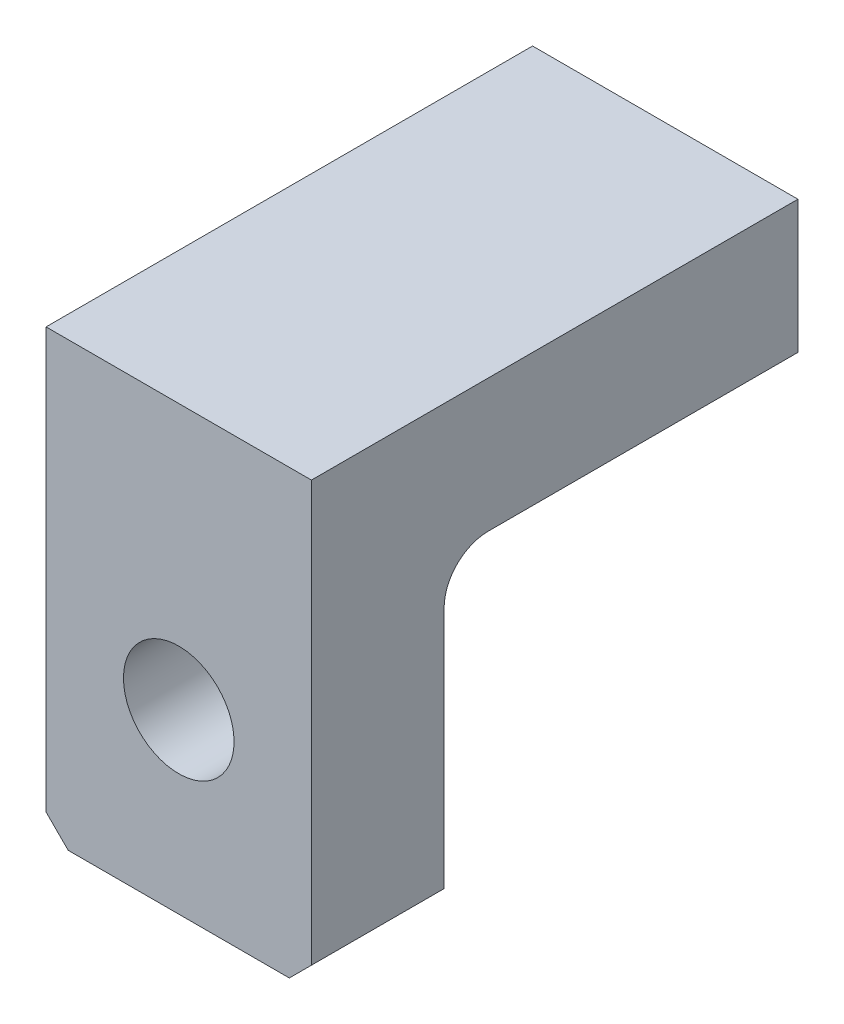
ISO-10303-21;
HEADER;
FILE_DESCRIPTION(('STEP AP214'),'2;1');
FILE_NAME('part.step','',(''),(''),'','','');
FILE_SCHEMA(('AUTOMOTIVE_DESIGN { 1 0 10303 214 1 1 1 1 }'));
ENDSEC;
DATA;
#1=APPLICATION_CONTEXT('core data for automotive mechanical design processes');
#2=APPLICATION_PROTOCOL_DEFINITION('international standard','automotive_design',2000,#1);
#3=PRODUCT_CONTEXT('',#1,'mechanical');
#4=PRODUCT('Part','Part','',(#3));
#5=PRODUCT_RELATED_PRODUCT_CATEGORY('part','',(#4));
#6=PRODUCT_DEFINITION_FORMATION('','',#4);
#7=PRODUCT_DEFINITION_CONTEXT('part definition',#1,'design');
#8=PRODUCT_DEFINITION('design','',#6,#7);
#9=PRODUCT_DEFINITION_SHAPE('','',#8);
#10=(LENGTH_UNIT() NAMED_UNIT(*) SI_UNIT(.MILLI.,.METRE.));
#11=(NAMED_UNIT(*) PLANE_ANGLE_UNIT() SI_UNIT($,.RADIAN.));
#12=(NAMED_UNIT(*) SI_UNIT($,.STERADIAN.) SOLID_ANGLE_UNIT());
#13=UNCERTAINTY_MEASURE_WITH_UNIT(LENGTH_MEASURE(1.E-05),#10,'distance_accuracy_value','');
#14=(GEOMETRIC_REPRESENTATION_CONTEXT(3) GLOBAL_UNCERTAINTY_ASSIGNED_CONTEXT((#13)) GLOBAL_UNIT_ASSIGNED_CONTEXT((#10,
#11,#12)) REPRESENTATION_CONTEXT('',''));
#15=CARTESIAN_POINT('',(0.,0.,0.));
#16=DIRECTION('',(0.,0.,1.));
#17=DIRECTION('',(1.,0.,0.));
#18=AXIS2_PLACEMENT_3D('',#15,#16,#17);
#19=CARTESIAN_POINT('',(0.,0.,30.));
#20=DIRECTION('',(1.,0.,0.));
#21=DIRECTION('',(0.,0.,-1.));
#22=AXIS2_PLACEMENT_3D('',#19,#20,#21);
#23=PLANE('',#22);
#24=DIRECTION('',(0.,-1.,0.));
#25=VECTOR('',#24,1.);
#26=CARTESIAN_POINT('',(0.,0.,0.));
#27=LINE('',#26,#25);
#28=CARTESIAN_POINT('',(0.,60.,0.));
#29=VERTEX_POINT('',#28);
#30=CARTESIAN_POINT('',(0.,5.,0.));
#31=VERTEX_POINT('',#30);
#32=EDGE_CURVE('E136',#29,#31,#27,.T.);
#33=ORIENTED_EDGE('',*,*,#32,.T.);
#34=DIRECTION('',(0.,0.,1.));
#35=VECTOR('',#34,1.);
#36=CARTESIAN_POINT('',(0.,5.,30.));
#37=LINE('',#36,#35);
#38=CARTESIAN_POINT('',(0.,5.,30.));
#39=VERTEX_POINT('',#38);
#40=EDGE_CURVE('E58',#31,#39,#37,.T.);
#41=ORIENTED_EDGE('',*,*,#40,.T.);
#42=DIRECTION('',(0.,-1.,0.));
#43=VECTOR('',#42,1.);
#44=CARTESIAN_POINT('',(0.,0.,30.));
#45=LINE('',#44,#43);
#46=CARTESIAN_POINT('',(0.,100.,30.));
#47=VERTEX_POINT('',#46);
#48=EDGE_CURVE('E143',#47,#39,#45,.T.);
#49=ORIENTED_EDGE('',*,*,#48,.F.);
#50=DIRECTION('',(0.,0.,-1.));
#51=VECTOR('',#50,1.);
#52=CARTESIAN_POINT('',(0.,100.,30.));
#53=LINE('',#52,#51);
#54=CARTESIAN_POINT('',(0.,100.,-80.));
#55=VERTEX_POINT('',#54);
#56=EDGE_CURVE('E151',#47,#55,#53,.T.);
#57=ORIENTED_EDGE('',*,*,#56,.T.);
#58=DIRECTION('',(0.,1.,0.));
#59=VECTOR('',#58,1.);
#60=CARTESIAN_POINT('',(0.,100.,-80.));
#61=LINE('',#60,#59);
#62=CARTESIAN_POINT('',(0.,70.,-80.));
#63=VERTEX_POINT('',#62);
#64=EDGE_CURVE('E121',#63,#55,#61,.T.);
#65=ORIENTED_EDGE('',*,*,#64,.F.);
#66=DIRECTION('',(0.,0.,1.));
#67=VECTOR('',#66,1.);
#68=CARTESIAN_POINT('',(0.,70.,-80.));
#69=LINE('',#68,#67);
#70=CARTESIAN_POINT('',(0.,70.,-9.99999999999999));
#71=VERTEX_POINT('',#70);
#72=EDGE_CURVE('E117',#63,#71,#69,.T.);
#73=ORIENTED_EDGE('',*,*,#72,.T.);
#74=CARTESIAN_POINT('',(0.,60.,-9.99999999999999));
#75=DIRECTION('',(1.,0.,0.));
#76=DIRECTION('',(0.,0.,-1.));
#77=AXIS2_PLACEMENT_3D('',#74,#75,#76);
#78=CIRCLE('',#77,10.);
#79=EDGE_CURVE('E164',#71,#29,#78,.T.);
#80=ORIENTED_EDGE('',*,*,#79,.T.);
#81=EDGE_LOOP('',(#33,#41,#49,#57,#65,#73,#80));
#82=FACE_BOUND('',#81,.T.);
#83=ADVANCED_FACE('F35',(#82),#23,.F.);
#84=CARTESIAN_POINT('',(0.,0.,30.));
#85=DIRECTION('',(0.,1.,0.));
#86=DIRECTION('',(0.,0.,1.));
#87=AXIS2_PLACEMENT_3D('',#84,#85,#86);
#88=PLANE('',#87);
#89=DIRECTION('',(1.,0.,0.));
#90=VECTOR('',#89,1.);
#91=CARTESIAN_POINT('',(0.,0.,30.));
#92=LINE('',#91,#90);
#93=CARTESIAN_POINT('',(4.99999999999999,0.,30.));
#94=VERTEX_POINT('',#93);
#95=CARTESIAN_POINT('',(55.,0.,30.));
#96=VERTEX_POINT('',#95);
#97=EDGE_CURVE('E145',#94,#96,#92,.T.);
#98=ORIENTED_EDGE('',*,*,#97,.F.);
#99=DIRECTION('',(0.,0.,-1.));
#100=VECTOR('',#99,1.);
#101=CARTESIAN_POINT('',(4.99999999999999,0.,30.));
#102=LINE('',#101,#100);
#103=CARTESIAN_POINT('',(4.99999999999999,0.,0.));
#104=VERTEX_POINT('',#103);
#105=EDGE_CURVE('E169',#94,#104,#102,.T.);
#106=ORIENTED_EDGE('',*,*,#105,.T.);
#107=DIRECTION('',(1.,0.,0.));
#108=VECTOR('',#107,1.);
#109=CARTESIAN_POINT('',(0.,0.,0.));
#110=LINE('',#109,#108);
#111=CARTESIAN_POINT('',(55.,0.,0.));
#112=VERTEX_POINT('',#111);
#113=EDGE_CURVE('E138',#104,#112,#110,.T.);
#114=ORIENTED_EDGE('',*,*,#113,.T.);
#115=DIRECTION('',(0.,0.,1.));
#116=VECTOR('',#115,1.);
#117=CARTESIAN_POINT('',(55.,0.,30.));
#118=LINE('',#117,#116);
#119=EDGE_CURVE('E167',#112,#96,#118,.T.);
#120=ORIENTED_EDGE('',*,*,#119,.T.);
#121=EDGE_LOOP('',(#98,#106,#114,#120));
#122=FACE_BOUND('',#121,.T.);
#123=ADVANCED_FACE('F183',(#122),#88,.F.);
#124=CARTESIAN_POINT('',(60.,0.,30.));
#125=DIRECTION('',(-1.,0.,0.));
#126=DIRECTION('',(0.,0.,1.));
#127=AXIS2_PLACEMENT_3D('',#124,#125,#126);
#128=PLANE('',#127);
#129=DIRECTION('',(0.,1.,0.));
#130=VECTOR('',#129,1.);
#131=CARTESIAN_POINT('',(60.,0.,30.));
#132=LINE('',#131,#130);
#133=CARTESIAN_POINT('',(60.,4.99999999999999,30.));
#134=VERTEX_POINT('',#133);
#135=CARTESIAN_POINT('',(60.,100.,30.));
#136=VERTEX_POINT('',#135);
#137=EDGE_CURVE('E148',#134,#136,#132,.T.);
#138=ORIENTED_EDGE('',*,*,#137,.F.);
#139=DIRECTION('',(0.,0.,-1.));
#140=VECTOR('',#139,1.);
#141=CARTESIAN_POINT('',(60.,4.99999999999999,30.));
#142=LINE('',#141,#140);
#143=CARTESIAN_POINT('',(60.,4.99999999999999,0.));
#144=VERTEX_POINT('',#143);
#145=EDGE_CURVE('E11',#134,#144,#142,.T.);
#146=ORIENTED_EDGE('',*,*,#145,.T.);
#147=DIRECTION('',(0.,1.,0.));
#148=VECTOR('',#147,1.);
#149=CARTESIAN_POINT('',(60.,0.,0.));
#150=LINE('',#149,#148);
#151=CARTESIAN_POINT('',(60.,60.,0.));
#152=VERTEX_POINT('',#151);
#153=EDGE_CURVE('E146',#144,#152,#150,.T.);
#154=ORIENTED_EDGE('',*,*,#153,.T.);
#155=CARTESIAN_POINT('',(60.,60.,-9.99999999999999));
#156=DIRECTION('',(-1.,0.,0.));
#157=DIRECTION('',(0.,0.,1.));
#158=AXIS2_PLACEMENT_3D('',#155,#156,#157);
#159=CIRCLE('',#158,10.);
#160=CARTESIAN_POINT('',(60.,70.,-9.99999999999999));
#161=VERTEX_POINT('',#160);
#162=EDGE_CURVE('E135',#152,#161,#159,.T.);
#163=ORIENTED_EDGE('',*,*,#162,.T.);
#164=DIRECTION('',(0.,0.,1.));
#165=VECTOR('',#164,1.);
#166=CARTESIAN_POINT('',(60.,70.,-80.));
#167=LINE('',#166,#165);
#168=CARTESIAN_POINT('',(60.,70.,-80.));
#169=VERTEX_POINT('',#168);
#170=EDGE_CURVE('E114',#169,#161,#167,.T.);
#171=ORIENTED_EDGE('',*,*,#170,.F.);
#172=DIRECTION('',(0.,-1.,0.));
#173=VECTOR('',#172,1.);
#174=CARTESIAN_POINT('',(60.,100.,-80.));
#175=LINE('',#174,#173);
#176=CARTESIAN_POINT('',(60.,100.,-80.));
#177=VERTEX_POINT('',#176);
#178=EDGE_CURVE('E122',#177,#169,#175,.T.);
#179=ORIENTED_EDGE('',*,*,#178,.F.);
#180=DIRECTION('',(0.,0.,-1.));
#181=VECTOR('',#180,1.);
#182=CARTESIAN_POINT('',(60.,100.,30.));
#183=LINE('',#182,#181);
#184=EDGE_CURVE('E157',#136,#177,#183,.T.);
#185=ORIENTED_EDGE('',*,*,#184,.F.);
#186=EDGE_LOOP('',(#138,#146,#154,#163,#171,#179,#185));
#187=FACE_BOUND('',#186,.T.);
#188=ADVANCED_FACE('F133',(#187),#128,.F.);
#189=CARTESIAN_POINT('',(0.,100.,30.));
#190=DIRECTION('',(0.,-1.,0.));
#191=DIRECTION('',(0.,0.,-1.));
#192=AXIS2_PLACEMENT_3D('',#189,#190,#191);
#193=PLANE('',#192);
#194=ORIENTED_EDGE('',*,*,#184,.T.);
#195=DIRECTION('',(1.,0.,0.));
#196=VECTOR('',#195,1.);
#197=CARTESIAN_POINT('',(60.,100.,-80.));
#198=LINE('',#197,#196);
#199=EDGE_CURVE('E128',#55,#177,#198,.T.);
#200=ORIENTED_EDGE('',*,*,#199,.F.);
#201=ORIENTED_EDGE('',*,*,#56,.F.);
#202=DIRECTION('',(-1.,0.,0.));
#203=VECTOR('',#202,1.);
#204=CARTESIAN_POINT('',(0.,100.,30.));
#205=LINE('',#204,#203);
#206=EDGE_CURVE('E150',#136,#47,#205,.T.);
#207=ORIENTED_EDGE('',*,*,#206,.F.);
#208=EDGE_LOOP('',(#194,#200,#201,#207));
#209=FACE_BOUND('',#208,.T.);
#210=ADVANCED_FACE('F226',(#209),#193,.F.);
#211=CARTESIAN_POINT('',(0.,0.,30.));
#212=DIRECTION('',(0.,0.,-1.));
#213=DIRECTION('',(-1.,0.,0.));
#214=AXIS2_PLACEMENT_3D('',#211,#212,#213);
#215=PLANE('',#214);
#216=CARTESIAN_POINT('',(30.,40.,30.));
#217=DIRECTION('',(0.,0.,-1.));
#218=DIRECTION('',(-1.,0.,0.));
#219=AXIS2_PLACEMENT_3D('',#216,#217,#218);
#220=CIRCLE('',#219,12.5);
#221=CARTESIAN_POINT('',(17.5,40.,30.));
#222=VERTEX_POINT('',#221);
#223=EDGE_CURVE('E131',#222,#222,#220,.T.);
#224=ORIENTED_EDGE('',*,*,#223,.T.);
#225=EDGE_LOOP('',(#224));
#226=FACE_BOUND('',#225,.T.);
#227=ORIENTED_EDGE('',*,*,#48,.T.);
#228=DIRECTION('',(-0.707106781186547,0.707106781186549,0.));
#229=VECTOR('',#228,1.);
#230=CARTESIAN_POINT('',(4.99999999999999,0.,30.));
#231=LINE('',#230,#229);
#232=EDGE_CURVE('E43',#39,#94,#231,.F.);
#233=ORIENTED_EDGE('',*,*,#232,.T.);
#234=ORIENTED_EDGE('',*,*,#97,.T.);
#235=DIRECTION('',(-0.707106781186549,-0.707106781186547,0.));
#236=VECTOR('',#235,1.);
#237=CARTESIAN_POINT('',(60.,4.99999999999999,30.));
#238=LINE('',#237,#236);
#239=EDGE_CURVE('E50',#96,#134,#238,.F.);
#240=ORIENTED_EDGE('',*,*,#239,.T.);
#241=ORIENTED_EDGE('',*,*,#137,.T.);
#242=ORIENTED_EDGE('',*,*,#206,.T.);
#243=EDGE_LOOP('',(#227,#233,#234,#240,#241,#242));
#244=FACE_BOUND('',#243,.T.);
#245=ADVANCED_FACE('F179',(#226,#244),#215,.F.);
#246=CARTESIAN_POINT('',(0.,0.,0.));
#247=DIRECTION('',(0.,0.,-1.));
#248=DIRECTION('',(-1.,0.,0.));
#249=AXIS2_PLACEMENT_3D('',#246,#247,#248);
#250=PLANE('',#249);
#251=CARTESIAN_POINT('',(30.,40.,0.));
#252=DIRECTION('',(0.,0.,-1.));
#253=DIRECTION('',(-1.,0.,0.));
#254=AXIS2_PLACEMENT_3D('',#251,#252,#253);
#255=CIRCLE('',#254,12.5);
#256=CARTESIAN_POINT('',(17.5,40.,0.));
#257=VERTEX_POINT('',#256);
#258=EDGE_CURVE('E313',#257,#257,#255,.T.);
#259=ORIENTED_EDGE('',*,*,#258,.F.);
#260=EDGE_LOOP('',(#259));
#261=FACE_BOUND('',#260,.T.);
#262=ORIENTED_EDGE('',*,*,#113,.F.);
#263=DIRECTION('',(0.707106781186547,-0.707106781186549,0.));
#264=VECTOR('',#263,1.);
#265=CARTESIAN_POINT('',(2.5,2.5,0.));
#266=LINE('',#265,#264);
#267=EDGE_CURVE('E174',#104,#31,#266,.F.);
#268=ORIENTED_EDGE('',*,*,#267,.T.);
#269=ORIENTED_EDGE('',*,*,#32,.F.);
#270=DIRECTION('',(-1.,0.,0.));
#271=VECTOR('',#270,1.);
#272=CARTESIAN_POINT('',(0.,60.,0.));
#273=LINE('',#272,#271);
#274=EDGE_CURVE('E161',#29,#152,#273,.F.);
#275=ORIENTED_EDGE('',*,*,#274,.T.);
#276=ORIENTED_EDGE('',*,*,#153,.F.);
#277=DIRECTION('',(0.707106781186549,0.707106781186547,0.));
#278=VECTOR('',#277,1.);
#279=CARTESIAN_POINT('',(27.4999999999999,-27.5,0.));
#280=LINE('',#279,#278);
#281=EDGE_CURVE('E172',#144,#112,#280,.F.);
#282=ORIENTED_EDGE('',*,*,#281,.T.);
#283=EDGE_LOOP('',(#262,#268,#269,#275,#276,#282));
#284=FACE_BOUND('',#283,.T.);
#285=ADVANCED_FACE('F189',(#261,#284),#250,.T.);
#286=CARTESIAN_POINT('',(60.,70.,-80.));
#287=DIRECTION('',(0.,1.,0.));
#288=DIRECTION('',(0.,0.,1.));
#289=AXIS2_PLACEMENT_3D('',#286,#287,#288);
#290=PLANE('',#289);
#291=ORIENTED_EDGE('',*,*,#170,.T.);
#292=DIRECTION('',(-1.,0.,0.));
#293=VECTOR('',#292,1.);
#294=CARTESIAN_POINT('',(60.,70.,-9.99999999999999));
#295=LINE('',#294,#293);
#296=EDGE_CURVE('E159',#161,#71,#295,.T.);
#297=ORIENTED_EDGE('',*,*,#296,.T.);
#298=ORIENTED_EDGE('',*,*,#72,.F.);
#299=DIRECTION('',(-1.,0.,0.));
#300=VECTOR('',#299,1.);
#301=CARTESIAN_POINT('',(60.,70.,-80.));
#302=LINE('',#301,#300);
#303=EDGE_CURVE('E109',#169,#63,#302,.T.);
#304=ORIENTED_EDGE('',*,*,#303,.F.);
#305=EDGE_LOOP('',(#291,#297,#298,#304));
#306=FACE_BOUND('',#305,.T.);
#307=ADVANCED_FACE('F111',(#306),#290,.F.);
#308=CARTESIAN_POINT('',(0.,0.,-80.));
#309=DIRECTION('',(0.,0.,-1.));
#310=DIRECTION('',(-1.,0.,0.));
#311=AXIS2_PLACEMENT_3D('',#308,#309,#310);
#312=PLANE('',#311);
#313=ORIENTED_EDGE('',*,*,#178,.T.);
#314=ORIENTED_EDGE('',*,*,#303,.T.);
#315=ORIENTED_EDGE('',*,*,#64,.T.);
#316=ORIENTED_EDGE('',*,*,#199,.T.);
#317=EDGE_LOOP('',(#313,#314,#315,#316));
#318=FACE_BOUND('',#317,.T.);
#319=ADVANCED_FACE('F126',(#318),#312,.T.);
#320=CARTESIAN_POINT('',(30.,40.,80.));
#321=DIRECTION('',(0.,0.,-1.));
#322=DIRECTION('',(-1.,0.,0.));
#323=AXIS2_PLACEMENT_3D('',#320,#321,#322);
#324=CYLINDRICAL_SURFACE('',#323,12.5);
#325=ORIENTED_EDGE('',*,*,#258,.T.);
#326=EDGE_LOOP('',(#325));
#327=FACE_BOUND('',#326,.T.);
#328=ORIENTED_EDGE('',*,*,#223,.F.);
#329=EDGE_LOOP('',(#328));
#330=FACE_BOUND('',#329,.T.);
#331=ADVANCED_FACE('F209',(#327,#330),#324,.F.);
#332=CARTESIAN_POINT('',(60.,60.,-9.99999999999999));
#333=DIRECTION('',(-1.,0.,0.));
#334=DIRECTION('',(0.,0.,1.));
#335=AXIS2_PLACEMENT_3D('',#332,#333,#334);
#336=CYLINDRICAL_SURFACE('',#335,10.);
#337=ORIENTED_EDGE('',*,*,#162,.F.);
#338=ORIENTED_EDGE('',*,*,#274,.F.);
#339=ORIENTED_EDGE('',*,*,#79,.F.);
#340=ORIENTED_EDGE('',*,*,#296,.F.);
#341=EDGE_LOOP('',(#337,#338,#339,#340));
#342=FACE_BOUND('',#341,.T.);
#343=ADVANCED_FACE('F192',(#342),#336,.F.);
#344=CARTESIAN_POINT('',(4.99999999999999,0.,30.));
#345=DIRECTION('',(0.707106781186548,0.707106781186546,0.));
#346=DIRECTION('',(0.,0.,-1.));
#347=AXIS2_PLACEMENT_3D('',#344,#345,#346);
#348=PLANE('',#347);
#349=ORIENTED_EDGE('',*,*,#232,.F.);
#350=ORIENTED_EDGE('',*,*,#40,.F.);
#351=ORIENTED_EDGE('',*,*,#267,.F.);
#352=ORIENTED_EDGE('',*,*,#105,.F.);
#353=EDGE_LOOP('',(#349,#350,#351,#352));
#354=FACE_BOUND('',#353,.T.);
#355=ADVANCED_FACE('F186',(#354),#348,.F.);
#356=CARTESIAN_POINT('',(60.,4.99999999999999,30.));
#357=DIRECTION('',(-0.707106781186546,0.707106781186548,0.));
#358=DIRECTION('',(0.,0.,-1.));
#359=AXIS2_PLACEMENT_3D('',#356,#357,#358);
#360=PLANE('',#359);
#361=ORIENTED_EDGE('',*,*,#239,.F.);
#362=ORIENTED_EDGE('',*,*,#119,.F.);
#363=ORIENTED_EDGE('',*,*,#281,.F.);
#364=ORIENTED_EDGE('',*,*,#145,.F.);
#365=EDGE_LOOP('',(#361,#362,#363,#364));
#366=FACE_BOUND('',#365,.T.);
#367=ADVANCED_FACE('F37',(#366),#360,.F.);
#368=CLOSED_SHELL('',(#83,#123,#188,#210,#245,#285,#307,#319,#331,#343,#355,#367));
#369=MANIFOLD_SOLID_BREP('B2',#368);
#370=ADVANCED_BREP_SHAPE_REPRESENTATION('',(#18,#369),#14);
#371=SHAPE_DEFINITION_REPRESENTATION(#9,#370);
ENDSEC;
END-ISO-10303-21;
